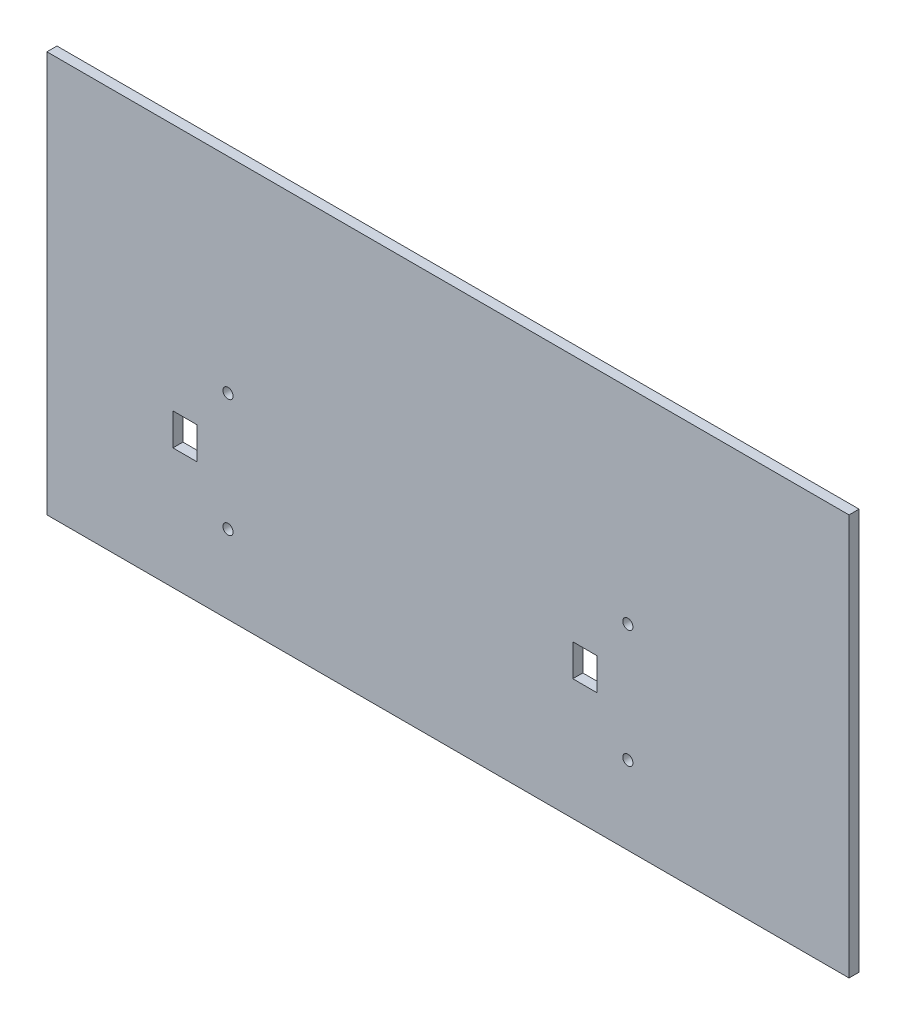
ISO-10303-21;
HEADER;
FILE_DESCRIPTION(('STEP AP214'),'2;1');
FILE_NAME('part.step','',(''),(''),'','','');
FILE_SCHEMA(('AUTOMOTIVE_DESIGN { 1 0 10303 214 1 1 1 1 }'));
ENDSEC;
DATA;
#1=APPLICATION_CONTEXT('core data for automotive mechanical design processes');
#2=APPLICATION_PROTOCOL_DEFINITION('international standard','automotive_design',2000,#1);
#3=PRODUCT_CONTEXT('',#1,'mechanical');
#4=PRODUCT('Part','Part','',(#3));
#5=PRODUCT_RELATED_PRODUCT_CATEGORY('part','',(#4));
#6=PRODUCT_DEFINITION_FORMATION('','',#4);
#7=PRODUCT_DEFINITION_CONTEXT('part definition',#1,'design');
#8=PRODUCT_DEFINITION('design','',#6,#7);
#9=PRODUCT_DEFINITION_SHAPE('','',#8);
#10=(LENGTH_UNIT() NAMED_UNIT(*) SI_UNIT(.MILLI.,.METRE.));
#11=(NAMED_UNIT(*) PLANE_ANGLE_UNIT() SI_UNIT($,.RADIAN.));
#12=(NAMED_UNIT(*) SI_UNIT($,.STERADIAN.) SOLID_ANGLE_UNIT());
#13=UNCERTAINTY_MEASURE_WITH_UNIT(LENGTH_MEASURE(1.E-05),#10,'distance_accuracy_value','');
#14=(GEOMETRIC_REPRESENTATION_CONTEXT(3) GLOBAL_UNCERTAINTY_ASSIGNED_CONTEXT((#13)) GLOBAL_UNIT_ASSIGNED_CONTEXT((#10,
#11,#12)) REPRESENTATION_CONTEXT('',''));
#15=CARTESIAN_POINT('',(0.,0.,0.));
#16=DIRECTION('',(0.,0.,1.));
#17=DIRECTION('',(1.,0.,0.));
#18=AXIS2_PLACEMENT_3D('',#15,#16,#17);
#19=CARTESIAN_POINT('',(127.,-63.5,1.5875));
#20=DIRECTION('',(-1.,0.,0.));
#21=DIRECTION('',(0.,0.,1.));
#22=AXIS2_PLACEMENT_3D('',#19,#20,#21);
#23=PLANE('',#22);
#24=DIRECTION('',(0.,1.,0.));
#25=VECTOR('',#24,1.);
#26=CARTESIAN_POINT('',(127.,-63.5,-1.5875));
#27=LINE('',#26,#25);
#28=CARTESIAN_POINT('',(127.,-63.5,-1.5875));
#29=VERTEX_POINT('',#28);
#30=CARTESIAN_POINT('',(127.,63.5,-1.5875));
#31=VERTEX_POINT('',#30);
#32=EDGE_CURVE('E215',#29,#31,#27,.T.);
#33=ORIENTED_EDGE('',*,*,#32,.T.);
#34=DIRECTION('',(0.,0.,-1.));
#35=VECTOR('',#34,1.);
#36=CARTESIAN_POINT('',(127.,63.5,1.5875));
#37=LINE('',#36,#35);
#38=CARTESIAN_POINT('',(127.,63.5,1.5875));
#39=VERTEX_POINT('',#38);
#40=EDGE_CURVE('E11',#39,#31,#37,.T.);
#41=ORIENTED_EDGE('',*,*,#40,.F.);
#42=DIRECTION('',(0.,1.,0.));
#43=VECTOR('',#42,1.);
#44=CARTESIAN_POINT('',(127.,-63.5,1.5875));
#45=LINE('',#44,#43);
#46=CARTESIAN_POINT('',(127.,-63.5,1.5875));
#47=VERTEX_POINT('',#46);
#48=EDGE_CURVE('E216',#47,#39,#45,.T.);
#49=ORIENTED_EDGE('',*,*,#48,.F.);
#50=DIRECTION('',(0.,0.,-1.));
#51=VECTOR('',#50,1.);
#52=CARTESIAN_POINT('',(127.,-63.5,1.5875));
#53=LINE('',#52,#51);
#54=EDGE_CURVE('E226',#47,#29,#53,.T.);
#55=ORIENTED_EDGE('',*,*,#54,.T.);
#56=EDGE_LOOP('',(#33,#41,#49,#55));
#57=FACE_BOUND('',#56,.T.);
#58=ADVANCED_FACE('F33',(#57),#23,.F.);
#59=CARTESIAN_POINT('',(-127.,63.5,1.5875));
#60=DIRECTION('',(0.,-1.,0.));
#61=DIRECTION('',(0.,0.,-1.));
#62=AXIS2_PLACEMENT_3D('',#59,#60,#61);
#63=PLANE('',#62);
#64=DIRECTION('',(-1.,0.,0.));
#65=VECTOR('',#64,1.);
#66=CARTESIAN_POINT('',(-127.,63.5,-1.5875));
#67=LINE('',#66,#65);
#68=CARTESIAN_POINT('',(-127.,63.5,-1.5875));
#69=VERTEX_POINT('',#68);
#70=EDGE_CURVE('E229',#31,#69,#67,.T.);
#71=ORIENTED_EDGE('',*,*,#70,.T.);
#72=DIRECTION('',(0.,0.,-1.));
#73=VECTOR('',#72,1.);
#74=CARTESIAN_POINT('',(-127.,63.5,1.5875));
#75=LINE('',#74,#73);
#76=CARTESIAN_POINT('',(-127.,63.5,1.5875));
#77=VERTEX_POINT('',#76);
#78=EDGE_CURVE('E40',#77,#69,#75,.T.);
#79=ORIENTED_EDGE('',*,*,#78,.F.);
#80=DIRECTION('',(-1.,0.,0.));
#81=VECTOR('',#80,1.);
#82=CARTESIAN_POINT('',(-127.,63.5,1.5875));
#83=LINE('',#82,#81);
#84=EDGE_CURVE('E219',#39,#77,#83,.T.);
#85=ORIENTED_EDGE('',*,*,#84,.F.);
#86=ORIENTED_EDGE('',*,*,#40,.T.);
#87=EDGE_LOOP('',(#71,#79,#85,#86));
#88=FACE_BOUND('',#87,.T.);
#89=ADVANCED_FACE('F258',(#88),#63,.F.);
#90=CARTESIAN_POINT('',(-127.,-63.5,1.5875));
#91=DIRECTION('',(1.,0.,0.));
#92=DIRECTION('',(0.,0.,-1.));
#93=AXIS2_PLACEMENT_3D('',#90,#91,#92);
#94=PLANE('',#93);
#95=DIRECTION('',(0.,-1.,0.));
#96=VECTOR('',#95,1.);
#97=CARTESIAN_POINT('',(-127.,-63.5,-1.5875));
#98=LINE('',#97,#96);
#99=CARTESIAN_POINT('',(-127.,-63.5,-1.5875));
#100=VERTEX_POINT('',#99);
#101=EDGE_CURVE('E231',#69,#100,#98,.T.);
#102=ORIENTED_EDGE('',*,*,#101,.T.);
#103=DIRECTION('',(0.,0.,-1.));
#104=VECTOR('',#103,1.);
#105=CARTESIAN_POINT('',(-127.,-63.5,1.5875));
#106=LINE('',#105,#104);
#107=CARTESIAN_POINT('',(-127.,-63.5,1.5875));
#108=VERTEX_POINT('',#107);
#109=EDGE_CURVE('E236',#108,#100,#106,.T.);
#110=ORIENTED_EDGE('',*,*,#109,.F.);
#111=DIRECTION('',(0.,-1.,0.));
#112=VECTOR('',#111,1.);
#113=CARTESIAN_POINT('',(-127.,-63.5,1.5875));
#114=LINE('',#113,#112);
#115=EDGE_CURVE('E222',#77,#108,#114,.T.);
#116=ORIENTED_EDGE('',*,*,#115,.F.);
#117=ORIENTED_EDGE('',*,*,#78,.T.);
#118=EDGE_LOOP('',(#102,#110,#116,#117));
#119=FACE_BOUND('',#118,.T.);
#120=ADVANCED_FACE('F243',(#119),#94,.F.);
#121=CARTESIAN_POINT('',(-127.,-63.5,1.5875));
#122=DIRECTION('',(0.,1.,0.));
#123=DIRECTION('',(0.,0.,1.));
#124=AXIS2_PLACEMENT_3D('',#121,#122,#123);
#125=PLANE('',#124);
#126=DIRECTION('',(1.,0.,0.));
#127=VECTOR('',#126,1.);
#128=CARTESIAN_POINT('',(-127.,-63.5,-1.5875));
#129=LINE('',#128,#127);
#130=EDGE_CURVE('E220',#100,#29,#129,.T.);
#131=ORIENTED_EDGE('',*,*,#130,.T.);
#132=ORIENTED_EDGE('',*,*,#54,.F.);
#133=DIRECTION('',(1.,0.,0.));
#134=VECTOR('',#133,1.);
#135=CARTESIAN_POINT('',(-127.,-63.5,1.5875));
#136=LINE('',#135,#134);
#137=EDGE_CURVE('E224',#108,#47,#136,.T.);
#138=ORIENTED_EDGE('',*,*,#137,.F.);
#139=ORIENTED_EDGE('',*,*,#109,.T.);
#140=EDGE_LOOP('',(#131,#132,#138,#139));
#141=FACE_BOUND('',#140,.T.);
#142=ADVANCED_FACE('F251',(#141),#125,.F.);
#143=CARTESIAN_POINT('',(0.,0.,1.5875));
#144=DIRECTION('',(0.,0.,-1.));
#145=DIRECTION('',(-1.,0.,0.));
#146=AXIS2_PLACEMENT_3D('',#143,#144,#145);
#147=PLANE('',#146);
#148=CARTESIAN_POINT('',(56.9550000089999,-38.74,1.5875));
#149=DIRECTION('',(0.,0.,-1.));
#150=DIRECTION('',(-1.,0.,0.));
#151=AXIS2_PLACEMENT_3D('',#148,#149,#150);
#152=CIRCLE('',#151,1.61);
#153=CARTESIAN_POINT('',(55.3450000089999,-38.74,1.5875));
#154=VERTEX_POINT('',#153);
#155=EDGE_CURVE('E212',#154,#154,#152,.T.);
#156=ORIENTED_EDGE('',*,*,#155,.T.);
#157=EDGE_LOOP('',(#156));
#158=FACE_BOUND('',#157,.T.);
#159=CARTESIAN_POINT('',(-69.6550000077737,-38.74,1.5875));
#160=DIRECTION('',(0.,0.,-1.));
#161=DIRECTION('',(-1.,0.,0.));
#162=AXIS2_PLACEMENT_3D('',#159,#160,#161);
#163=CIRCLE('',#162,1.61);
#164=CARTESIAN_POINT('',(-71.2650000077737,-38.74,1.5875));
#165=VERTEX_POINT('',#164);
#166=EDGE_CURVE('E209',#165,#165,#163,.T.);
#167=ORIENTED_EDGE('',*,*,#166,.T.);
#168=EDGE_LOOP('',(#167));
#169=FACE_BOUND('',#168,.T.);
#170=CARTESIAN_POINT('',(-69.6550000077737,-1.46000000000006,1.5875));
#171=DIRECTION('',(0.,0.,-1.));
#172=DIRECTION('',(-1.,0.,0.));
#173=AXIS2_PLACEMENT_3D('',#170,#171,#172);
#174=CIRCLE('',#173,1.61);
#175=CARTESIAN_POINT('',(-71.2650000077737,-1.46000000000006,1.5875));
#176=VERTEX_POINT('',#175);
#177=EDGE_CURVE('E206',#176,#176,#174,.T.);
#178=ORIENTED_EDGE('',*,*,#177,.T.);
#179=EDGE_LOOP('',(#178));
#180=FACE_BOUND('',#179,.T.);
#181=DIRECTION('',(0.,1.,0.));
#182=VECTOR('',#181,1.);
#183=CARTESIAN_POINT('',(-87.0999999987736,0.,1.5875));
#184=LINE('',#183,#182);
#185=CARTESIAN_POINT('',(-87.0999999987736,-25.175,1.5875));
#186=VERTEX_POINT('',#185);
#187=CARTESIAN_POINT('',(-87.0999999987736,-15.025,1.5875));
#188=VERTEX_POINT('',#187);
#189=EDGE_CURVE('E200',#186,#188,#184,.T.);
#190=ORIENTED_EDGE('',*,*,#189,.T.);
#191=DIRECTION('',(1.,0.,0.));
#192=VECTOR('',#191,1.);
#193=CARTESIAN_POINT('',(0.,-15.025,1.5875));
#194=LINE('',#193,#192);
#195=CARTESIAN_POINT('',(-79.4799999987736,-15.025,1.5875));
#196=VERTEX_POINT('',#195);
#197=EDGE_CURVE('E203',#188,#196,#194,.T.);
#198=ORIENTED_EDGE('',*,*,#197,.T.);
#199=DIRECTION('',(0.,-1.,0.));
#200=VECTOR('',#199,1.);
#201=CARTESIAN_POINT('',(-79.4799999987736,0.,1.5875));
#202=LINE('',#201,#200);
#203=CARTESIAN_POINT('',(-79.4799999987736,-25.175,1.5875));
#204=VERTEX_POINT('',#203);
#205=EDGE_CURVE('E194',#196,#204,#202,.T.);
#206=ORIENTED_EDGE('',*,*,#205,.T.);
#207=DIRECTION('',(-1.,0.,0.));
#208=VECTOR('',#207,1.);
#209=CARTESIAN_POINT('',(0.,-25.1750000000001,1.5875));
#210=LINE('',#209,#208);
#211=EDGE_CURVE('E197',#204,#186,#210,.T.);
#212=ORIENTED_EDGE('',*,*,#211,.T.);
#213=EDGE_LOOP('',(#190,#198,#206,#212));
#214=FACE_BOUND('',#213,.T.);
#215=DIRECTION('',(0.,1.,0.));
#216=VECTOR('',#215,1.);
#217=CARTESIAN_POINT('',(39.5100000179999,0.,1.5875));
#218=LINE('',#217,#216);
#219=CARTESIAN_POINT('',(39.5100000179999,-25.175,1.5875));
#220=VERTEX_POINT('',#219);
#221=CARTESIAN_POINT('',(39.5100000179999,-15.025,1.5875));
#222=VERTEX_POINT('',#221);
#223=EDGE_CURVE('E188',#220,#222,#218,.T.);
#224=ORIENTED_EDGE('',*,*,#223,.T.);
#225=DIRECTION('',(1.,0.,0.));
#226=VECTOR('',#225,1.);
#227=CARTESIAN_POINT('',(0.,-15.025,1.5875));
#228=LINE('',#227,#226);
#229=CARTESIAN_POINT('',(47.1300000179999,-15.025,1.5875));
#230=VERTEX_POINT('',#229);
#231=EDGE_CURVE('E191',#222,#230,#228,.T.);
#232=ORIENTED_EDGE('',*,*,#231,.T.);
#233=DIRECTION('',(0.,-1.,0.));
#234=VECTOR('',#233,1.);
#235=CARTESIAN_POINT('',(47.1300000179999,0.,1.5875));
#236=LINE('',#235,#234);
#237=CARTESIAN_POINT('',(47.1300000179999,-25.175,1.5875));
#238=VERTEX_POINT('',#237);
#239=EDGE_CURVE('E185',#230,#238,#236,.T.);
#240=ORIENTED_EDGE('',*,*,#239,.T.);
#241=DIRECTION('',(-1.,0.,0.));
#242=VECTOR('',#241,1.);
#243=CARTESIAN_POINT('',(0.,-25.175,1.5875));
#244=LINE('',#243,#242);
#245=EDGE_CURVE('E126',#238,#220,#244,.T.);
#246=ORIENTED_EDGE('',*,*,#245,.T.);
#247=EDGE_LOOP('',(#224,#232,#240,#246));
#248=FACE_BOUND('',#247,.T.);
#249=CARTESIAN_POINT('',(56.9550000089999,-1.46000000000001,1.5875));
#250=DIRECTION('',(0.,0.,-1.));
#251=DIRECTION('',(-1.,0.,0.));
#252=AXIS2_PLACEMENT_3D('',#249,#250,#251);
#253=CIRCLE('',#252,1.61);
#254=CARTESIAN_POINT('',(55.3450000089999,-1.46000000000001,1.5875));
#255=VERTEX_POINT('',#254);
#256=EDGE_CURVE('E182',#255,#255,#253,.T.);
#257=ORIENTED_EDGE('',*,*,#256,.T.);
#258=EDGE_LOOP('',(#257));
#259=FACE_BOUND('',#258,.T.);
#260=ORIENTED_EDGE('',*,*,#48,.T.);
#261=ORIENTED_EDGE('',*,*,#84,.T.);
#262=ORIENTED_EDGE('',*,*,#115,.T.);
#263=ORIENTED_EDGE('',*,*,#137,.T.);
#264=EDGE_LOOP('',(#260,#261,#262,#263));
#265=FACE_BOUND('',#264,.T.);
#266=ADVANCED_FACE('F257',(#158,#169,#180,#214,#248,#259,#265),#147,.F.);
#267=CARTESIAN_POINT('',(0.,0.,-1.5875));
#268=DIRECTION('',(0.,0.,-1.));
#269=DIRECTION('',(-1.,0.,0.));
#270=AXIS2_PLACEMENT_3D('',#267,#268,#269);
#271=PLANE('',#270);
#272=CARTESIAN_POINT('',(56.9550000089999,-38.74,-1.5875));
#273=DIRECTION('',(0.,0.,-1.));
#274=DIRECTION('',(-1.,0.,0.));
#275=AXIS2_PLACEMENT_3D('',#272,#273,#274);
#276=CIRCLE('',#275,1.61);
#277=CARTESIAN_POINT('',(55.3450000089999,-38.74,-1.5875));
#278=VERTEX_POINT('',#277);
#279=EDGE_CURVE('E153',#278,#278,#276,.T.);
#280=ORIENTED_EDGE('',*,*,#279,.F.);
#281=EDGE_LOOP('',(#280));
#282=FACE_BOUND('',#281,.T.);
#283=CARTESIAN_POINT('',(-69.6550000077737,-38.74,-1.5875));
#284=DIRECTION('',(0.,0.,-1.));
#285=DIRECTION('',(-1.,0.,0.));
#286=AXIS2_PLACEMENT_3D('',#283,#284,#285);
#287=CIRCLE('',#286,1.61);
#288=CARTESIAN_POINT('',(-71.2650000077737,-38.74,-1.5875));
#289=VERTEX_POINT('',#288);
#290=EDGE_CURVE('E157',#289,#289,#287,.T.);
#291=ORIENTED_EDGE('',*,*,#290,.F.);
#292=EDGE_LOOP('',(#291));
#293=FACE_BOUND('',#292,.T.);
#294=CARTESIAN_POINT('',(-69.6550000077737,-1.46000000000006,-1.5875));
#295=DIRECTION('',(0.,0.,-1.));
#296=DIRECTION('',(-1.,0.,0.));
#297=AXIS2_PLACEMENT_3D('',#294,#295,#296);
#298=CIRCLE('',#297,1.61);
#299=CARTESIAN_POINT('',(-71.2650000077737,-1.46000000000006,-1.5875));
#300=VERTEX_POINT('',#299);
#301=EDGE_CURVE('E160',#300,#300,#298,.T.);
#302=ORIENTED_EDGE('',*,*,#301,.F.);
#303=EDGE_LOOP('',(#302));
#304=FACE_BOUND('',#303,.T.);
#305=DIRECTION('',(1.,0.,0.));
#306=VECTOR('',#305,1.);
#307=CARTESIAN_POINT('',(-79.4799999987736,-15.025,-1.5875));
#308=LINE('',#307,#306);
#309=CARTESIAN_POINT('',(-87.0999999987736,-15.025,-1.5875));
#310=VERTEX_POINT('',#309);
#311=CARTESIAN_POINT('',(-79.4799999987736,-15.025,-1.5875));
#312=VERTEX_POINT('',#311);
#313=EDGE_CURVE('E150',#310,#312,#308,.T.);
#314=ORIENTED_EDGE('',*,*,#313,.F.);
#315=DIRECTION('',(0.,1.,0.));
#316=VECTOR('',#315,1.);
#317=CARTESIAN_POINT('',(-87.0999999987736,-15.025,-1.5875));
#318=LINE('',#317,#316);
#319=CARTESIAN_POINT('',(-87.0999999987736,-25.175,-1.5875));
#320=VERTEX_POINT('',#319);
#321=EDGE_CURVE('E170',#320,#310,#318,.T.);
#322=ORIENTED_EDGE('',*,*,#321,.F.);
#323=DIRECTION('',(-1.,0.,0.));
#324=VECTOR('',#323,1.);
#325=CARTESIAN_POINT('',(-79.4799999987736,-25.175,-1.5875));
#326=LINE('',#325,#324);
#327=CARTESIAN_POINT('',(-79.4799999987736,-25.175,-1.5875));
#328=VERTEX_POINT('',#327);
#329=EDGE_CURVE('E167',#328,#320,#326,.T.);
#330=ORIENTED_EDGE('',*,*,#329,.F.);
#331=DIRECTION('',(0.,-1.,0.));
#332=VECTOR('',#331,1.);
#333=CARTESIAN_POINT('',(-79.4799999987736,-15.025,-1.5875));
#334=LINE('',#333,#332);
#335=EDGE_CURVE('E165',#312,#328,#334,.T.);
#336=ORIENTED_EDGE('',*,*,#335,.F.);
#337=EDGE_LOOP('',(#314,#322,#330,#336));
#338=FACE_BOUND('',#337,.T.);
#339=DIRECTION('',(1.,0.,0.));
#340=VECTOR('',#339,1.);
#341=CARTESIAN_POINT('',(47.1300000179999,-15.025,-1.5875));
#342=LINE('',#341,#340);
#343=CARTESIAN_POINT('',(39.5100000179999,-15.025,-1.5875));
#344=VERTEX_POINT('',#343);
#345=CARTESIAN_POINT('',(47.1300000179999,-15.025,-1.5875));
#346=VERTEX_POINT('',#345);
#347=EDGE_CURVE('E138',#344,#346,#342,.T.);
#348=ORIENTED_EDGE('',*,*,#347,.F.);
#349=DIRECTION('',(0.,1.,0.));
#350=VECTOR('',#349,1.);
#351=CARTESIAN_POINT('',(39.5100000179999,-15.025,-1.5875));
#352=LINE('',#351,#350);
#353=CARTESIAN_POINT('',(39.5100000179999,-25.175,-1.5875));
#354=VERTEX_POINT('',#353);
#355=EDGE_CURVE('E143',#354,#344,#352,.T.);
#356=ORIENTED_EDGE('',*,*,#355,.F.);
#357=DIRECTION('',(-1.,0.,0.));
#358=VECTOR('',#357,1.);
#359=CARTESIAN_POINT('',(47.1300000179999,-25.175,-1.5875));
#360=LINE('',#359,#358);
#361=CARTESIAN_POINT('',(47.1300000179999,-25.175,-1.5875));
#362=VERTEX_POINT('',#361);
#363=EDGE_CURVE('E123',#362,#354,#360,.T.);
#364=ORIENTED_EDGE('',*,*,#363,.F.);
#365=DIRECTION('',(0.,-1.,0.));
#366=VECTOR('',#365,1.);
#367=CARTESIAN_POINT('',(47.1300000179999,-15.025,-1.5875));
#368=LINE('',#367,#366);
#369=EDGE_CURVE('E133',#346,#362,#368,.T.);
#370=ORIENTED_EDGE('',*,*,#369,.F.);
#371=EDGE_LOOP('',(#348,#356,#364,#370));
#372=FACE_BOUND('',#371,.T.);
#373=CARTESIAN_POINT('',(56.9550000089999,-1.46000000000001,-1.5875));
#374=DIRECTION('',(0.,0.,-1.));
#375=DIRECTION('',(-1.,0.,0.));
#376=AXIS2_PLACEMENT_3D('',#373,#374,#375);
#377=CIRCLE('',#376,1.61);
#378=CARTESIAN_POINT('',(55.3450000089999,-1.46000000000001,-1.5875));
#379=VERTEX_POINT('',#378);
#380=EDGE_CURVE('E156',#379,#379,#377,.T.);
#381=ORIENTED_EDGE('',*,*,#380,.F.);
#382=EDGE_LOOP('',(#381));
#383=FACE_BOUND('',#382,.T.);
#384=ORIENTED_EDGE('',*,*,#32,.F.);
#385=ORIENTED_EDGE('',*,*,#130,.F.);
#386=ORIENTED_EDGE('',*,*,#101,.F.);
#387=ORIENTED_EDGE('',*,*,#70,.F.);
#388=EDGE_LOOP('',(#384,#385,#386,#387));
#389=FACE_BOUND('',#388,.T.);
#390=ADVANCED_FACE('F140',(#282,#293,#304,#338,#372,#383,#389),#271,.T.);
#391=CARTESIAN_POINT('',(56.9550000089999,-1.46000000000001,3.4925));
#392=DIRECTION('',(0.,0.,-1.));
#393=DIRECTION('',(-1.,0.,0.));
#394=AXIS2_PLACEMENT_3D('',#391,#392,#393);
#395=CYLINDRICAL_SURFACE('',#394,1.61);
#396=ORIENTED_EDGE('',*,*,#380,.T.);
#397=EDGE_LOOP('',(#396));
#398=FACE_BOUND('',#397,.T.);
#399=ORIENTED_EDGE('',*,*,#256,.F.);
#400=EDGE_LOOP('',(#399));
#401=FACE_BOUND('',#400,.T.);
#402=ADVANCED_FACE('F270',(#398,#401),#395,.F.);
#403=CARTESIAN_POINT('',(47.1300000179999,-15.025,3.4925));
#404=DIRECTION('',(0.,1.,0.));
#405=DIRECTION('',(-1.,0.,0.));
#406=AXIS2_PLACEMENT_3D('',#403,#404,#405);
#407=PLANE('',#406);
#408=DIRECTION('',(0.,0.,-1.));
#409=VECTOR('',#408,1.);
#410=CARTESIAN_POINT('',(39.5100000179999,-15.025,3.4925));
#411=LINE('',#410,#409);
#412=EDGE_CURVE('E148',#222,#344,#411,.T.);
#413=ORIENTED_EDGE('',*,*,#412,.T.);
#414=ORIENTED_EDGE('',*,*,#347,.T.);
#415=DIRECTION('',(0.,0.,-1.));
#416=VECTOR('',#415,1.);
#417=CARTESIAN_POINT('',(47.1300000179999,-15.025,3.4925));
#418=LINE('',#417,#416);
#419=EDGE_CURVE('E129',#230,#346,#418,.T.);
#420=ORIENTED_EDGE('',*,*,#419,.F.);
#421=ORIENTED_EDGE('',*,*,#231,.F.);
#422=EDGE_LOOP('',(#413,#414,#420,#421));
#423=FACE_BOUND('',#422,.T.);
#424=ADVANCED_FACE('F277',(#423),#407,.F.);
#425=CARTESIAN_POINT('',(39.5100000179999,-15.025,3.4925));
#426=DIRECTION('',(-1.,0.,0.));
#427=DIRECTION('',(0.,-1.,0.));
#428=AXIS2_PLACEMENT_3D('',#425,#426,#427);
#429=PLANE('',#428);
#430=DIRECTION('',(0.,0.,-1.));
#431=VECTOR('',#430,1.);
#432=CARTESIAN_POINT('',(39.5100000179999,-25.175,3.4925));
#433=LINE('',#432,#431);
#434=EDGE_CURVE('E128',#220,#354,#433,.T.);
#435=ORIENTED_EDGE('',*,*,#434,.T.);
#436=ORIENTED_EDGE('',*,*,#355,.T.);
#437=ORIENTED_EDGE('',*,*,#412,.F.);
#438=ORIENTED_EDGE('',*,*,#223,.F.);
#439=EDGE_LOOP('',(#435,#436,#437,#438));
#440=FACE_BOUND('',#439,.T.);
#441=ADVANCED_FACE('F308',(#440),#429,.F.);
#442=CARTESIAN_POINT('',(47.1300000179999,-25.175,3.4925));
#443=DIRECTION('',(0.,-1.,0.));
#444=DIRECTION('',(0.,0.,-1.));
#445=AXIS2_PLACEMENT_3D('',#442,#443,#444);
#446=PLANE('',#445);
#447=DIRECTION('',(0.,0.,-1.));
#448=VECTOR('',#447,1.);
#449=CARTESIAN_POINT('',(47.1300000179999,-25.175,3.4925));
#450=LINE('',#449,#448);
#451=EDGE_CURVE('E55',#238,#362,#450,.T.);
#452=ORIENTED_EDGE('',*,*,#451,.T.);
#453=ORIENTED_EDGE('',*,*,#363,.T.);
#454=ORIENTED_EDGE('',*,*,#434,.F.);
#455=ORIENTED_EDGE('',*,*,#245,.F.);
#456=EDGE_LOOP('',(#452,#453,#454,#455));
#457=FACE_BOUND('',#456,.T.);
#458=ADVANCED_FACE('F120',(#457),#446,.F.);
#459=CARTESIAN_POINT('',(47.1300000179999,-15.025,3.4925));
#460=DIRECTION('',(1.,0.,0.));
#461=DIRECTION('',(0.,0.,-1.));
#462=AXIS2_PLACEMENT_3D('',#459,#460,#461);
#463=PLANE('',#462);
#464=ORIENTED_EDGE('',*,*,#419,.T.);
#465=ORIENTED_EDGE('',*,*,#369,.T.);
#466=ORIENTED_EDGE('',*,*,#451,.F.);
#467=ORIENTED_EDGE('',*,*,#239,.F.);
#468=EDGE_LOOP('',(#464,#465,#466,#467));
#469=FACE_BOUND('',#468,.T.);
#470=ADVANCED_FACE('F134',(#469),#463,.F.);
#471=CARTESIAN_POINT('',(-79.4799999987736,-15.025,3.4925));
#472=DIRECTION('',(0.,1.,0.));
#473=DIRECTION('',(-1.,0.,0.));
#474=AXIS2_PLACEMENT_3D('',#471,#472,#473);
#475=PLANE('',#474);
#476=DIRECTION('',(0.,0.,-1.));
#477=VECTOR('',#476,1.);
#478=CARTESIAN_POINT('',(-87.0999999987736,-15.025,3.4925));
#479=LINE('',#478,#477);
#480=EDGE_CURVE('E163',#188,#310,#479,.T.);
#481=ORIENTED_EDGE('',*,*,#480,.T.);
#482=ORIENTED_EDGE('',*,*,#313,.T.);
#483=DIRECTION('',(0.,0.,-1.));
#484=VECTOR('',#483,1.);
#485=CARTESIAN_POINT('',(-79.4799999987736,-15.025,3.4925));
#486=LINE('',#485,#484);
#487=EDGE_CURVE('E173',#196,#312,#486,.T.);
#488=ORIENTED_EDGE('',*,*,#487,.F.);
#489=ORIENTED_EDGE('',*,*,#197,.F.);
#490=EDGE_LOOP('',(#481,#482,#488,#489));
#491=FACE_BOUND('',#490,.T.);
#492=ADVANCED_FACE('F279',(#491),#475,.F.);
#493=CARTESIAN_POINT('',(-87.0999999987736,-15.025,3.4925));
#494=DIRECTION('',(-1.,0.,0.));
#495=DIRECTION('',(0.,0.,1.));
#496=AXIS2_PLACEMENT_3D('',#493,#494,#495);
#497=PLANE('',#496);
#498=DIRECTION('',(0.,0.,-1.));
#499=VECTOR('',#498,1.);
#500=CARTESIAN_POINT('',(-87.0999999987736,-25.175,3.4925));
#501=LINE('',#500,#499);
#502=EDGE_CURVE('E175',#186,#320,#501,.T.);
#503=ORIENTED_EDGE('',*,*,#502,.T.);
#504=ORIENTED_EDGE('',*,*,#321,.T.);
#505=ORIENTED_EDGE('',*,*,#480,.F.);
#506=ORIENTED_EDGE('',*,*,#189,.F.);
#507=EDGE_LOOP('',(#503,#504,#505,#506));
#508=FACE_BOUND('',#507,.T.);
#509=ADVANCED_FACE('F282',(#508),#497,.F.);
#510=CARTESIAN_POINT('',(-79.4799999987736,-25.175,3.4925));
#511=DIRECTION('',(0.,-1.,0.));
#512=DIRECTION('',(1.,0.,0.));
#513=AXIS2_PLACEMENT_3D('',#510,#511,#512);
#514=PLANE('',#513);
#515=DIRECTION('',(0.,0.,-1.));
#516=VECTOR('',#515,1.);
#517=CARTESIAN_POINT('',(-79.4799999987736,-25.175,3.4925));
#518=LINE('',#517,#516);
#519=EDGE_CURVE('E47',#204,#328,#518,.T.);
#520=ORIENTED_EDGE('',*,*,#519,.T.);
#521=ORIENTED_EDGE('',*,*,#329,.T.);
#522=ORIENTED_EDGE('',*,*,#502,.F.);
#523=ORIENTED_EDGE('',*,*,#211,.F.);
#524=EDGE_LOOP('',(#520,#521,#522,#523));
#525=FACE_BOUND('',#524,.T.);
#526=ADVANCED_FACE('F288',(#525),#514,.F.);
#527=CARTESIAN_POINT('',(-79.4799999987736,-15.025,3.4925));
#528=DIRECTION('',(1.,0.,0.));
#529=DIRECTION('',(0.,0.,-1.));
#530=AXIS2_PLACEMENT_3D('',#527,#528,#529);
#531=PLANE('',#530);
#532=ORIENTED_EDGE('',*,*,#487,.T.);
#533=ORIENTED_EDGE('',*,*,#335,.T.);
#534=ORIENTED_EDGE('',*,*,#519,.F.);
#535=ORIENTED_EDGE('',*,*,#205,.F.);
#536=EDGE_LOOP('',(#532,#533,#534,#535));
#537=FACE_BOUND('',#536,.T.);
#538=ADVANCED_FACE('F284',(#537),#531,.F.);
#539=CARTESIAN_POINT('',(-69.6550000077737,-1.46000000000006,3.4925));
#540=DIRECTION('',(0.,0.,-1.));
#541=DIRECTION('',(-1.,0.,0.));
#542=AXIS2_PLACEMENT_3D('',#539,#540,#541);
#543=CYLINDRICAL_SURFACE('',#542,1.61);
#544=ORIENTED_EDGE('',*,*,#301,.T.);
#545=EDGE_LOOP('',(#544));
#546=FACE_BOUND('',#545,.T.);
#547=ORIENTED_EDGE('',*,*,#177,.F.);
#548=EDGE_LOOP('',(#547));
#549=FACE_BOUND('',#548,.T.);
#550=ADVANCED_FACE('F287',(#546,#549),#543,.F.);
#551=CARTESIAN_POINT('',(-69.6550000077737,-38.74,3.4925));
#552=DIRECTION('',(0.,0.,-1.));
#553=DIRECTION('',(-1.,0.,0.));
#554=AXIS2_PLACEMENT_3D('',#551,#552,#553);
#555=CYLINDRICAL_SURFACE('',#554,1.61);
#556=ORIENTED_EDGE('',*,*,#290,.T.);
#557=EDGE_LOOP('',(#556));
#558=FACE_BOUND('',#557,.T.);
#559=ORIENTED_EDGE('',*,*,#166,.F.);
#560=EDGE_LOOP('',(#559));
#561=FACE_BOUND('',#560,.T.);
#562=ADVANCED_FACE('F297',(#558,#561),#555,.F.);
#563=CARTESIAN_POINT('',(56.9550000089999,-38.74,3.4925));
#564=DIRECTION('',(0.,0.,-1.));
#565=DIRECTION('',(-1.,0.,0.));
#566=AXIS2_PLACEMENT_3D('',#563,#564,#565);
#567=CYLINDRICAL_SURFACE('',#566,1.61);
#568=ORIENTED_EDGE('',*,*,#279,.T.);
#569=EDGE_LOOP('',(#568));
#570=FACE_BOUND('',#569,.T.);
#571=ORIENTED_EDGE('',*,*,#155,.F.);
#572=EDGE_LOOP('',(#571));
#573=FACE_BOUND('',#572,.T.);
#574=ADVANCED_FACE('F301',(#570,#573),#567,.F.);
#575=CLOSED_SHELL('',(#58,#89,#120,#142,#266,#390,#402,#424,#441,#458,#470,#492,#509,#526,#538,
#550,#562,#574));
#576=MANIFOLD_SOLID_BREP('B2',#575);
#577=ADVANCED_BREP_SHAPE_REPRESENTATION('',(#18,#576),#14);
#578=SHAPE_DEFINITION_REPRESENTATION(#9,#577);
ENDSEC;
END-ISO-10303-21;
